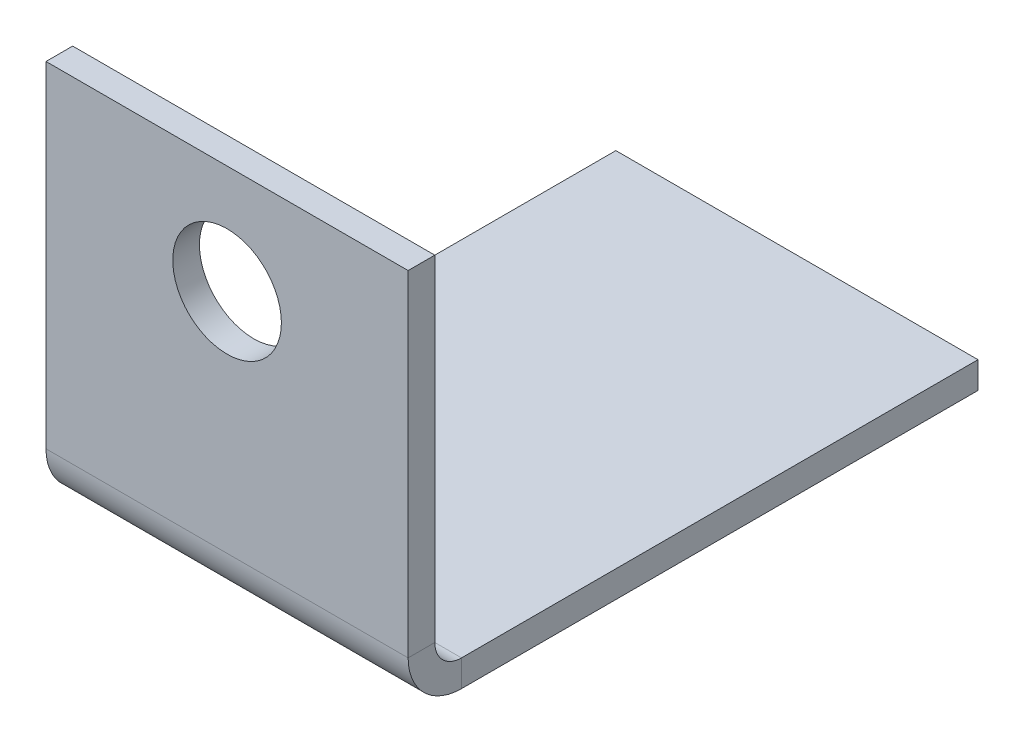
ISO-10303-21;
HEADER;
FILE_DESCRIPTION(('STEP AP214'),'2;1');
FILE_NAME('part.step','',(''),(''),'','','');
FILE_SCHEMA(('AUTOMOTIVE_DESIGN { 1 0 10303 214 1 1 1 1 }'));
ENDSEC;
DATA;
#1=APPLICATION_CONTEXT('core data for automotive mechanical design processes');
#2=APPLICATION_PROTOCOL_DEFINITION('international standard','automotive_design',2000,#1);
#3=PRODUCT_CONTEXT('',#1,'mechanical');
#4=PRODUCT('Part','Part','',(#3));
#5=PRODUCT_RELATED_PRODUCT_CATEGORY('part','',(#4));
#6=PRODUCT_DEFINITION_FORMATION('','',#4);
#7=PRODUCT_DEFINITION_CONTEXT('part definition',#1,'design');
#8=PRODUCT_DEFINITION('design','',#6,#7);
#9=PRODUCT_DEFINITION_SHAPE('','',#8);
#10=(LENGTH_UNIT() NAMED_UNIT(*) SI_UNIT(.MILLI.,.METRE.));
#11=(NAMED_UNIT(*) PLANE_ANGLE_UNIT() SI_UNIT($,.RADIAN.));
#12=(NAMED_UNIT(*) SI_UNIT($,.STERADIAN.) SOLID_ANGLE_UNIT());
#13=UNCERTAINTY_MEASURE_WITH_UNIT(LENGTH_MEASURE(1.E-05),#10,'distance_accuracy_value','');
#14=(GEOMETRIC_REPRESENTATION_CONTEXT(3) GLOBAL_UNCERTAINTY_ASSIGNED_CONTEXT((#13)) GLOBAL_UNIT_ASSIGNED_CONTEXT((#10,
#11,#12)) REPRESENTATION_CONTEXT('',''));
#15=CARTESIAN_POINT('',(0.,0.,0.));
#16=DIRECTION('',(0.,0.,1.));
#17=DIRECTION('',(1.,0.,0.));
#18=AXIS2_PLACEMENT_3D('',#15,#16,#17);
#19=CARTESIAN_POINT('',(5.,-0.7366,7.5));
#20=DIRECTION('',(1.,0.,0.));
#21=DIRECTION('',(0.,0.,-1.));
#22=AXIS2_PLACEMENT_3D('',#19,#20,#21);
#23=PLANE('',#22);
#24=DIRECTION('',(0.,0.,-1.));
#25=VECTOR('',#24,1.);
#26=CARTESIAN_POINT('',(5.,0.,7.5));
#27=LINE('',#26,#25);
#28=CARTESIAN_POINT('',(5.,0.,6.7634));
#29=VERTEX_POINT('',#28);
#30=CARTESIAN_POINT('',(5.,0.,-7.5));
#31=VERTEX_POINT('',#30);
#32=EDGE_CURVE('E91',#29,#31,#27,.T.);
#33=ORIENTED_EDGE('',*,*,#32,.F.);
#34=DIRECTION('',(0.,-1.,0.));
#35=VECTOR('',#34,1.);
#36=CARTESIAN_POINT('',(5.,0.,6.7634));
#37=LINE('',#36,#35);
#38=CARTESIAN_POINT('',(5.,-0.736600000000001,6.7634));
#39=VERTEX_POINT('',#38);
#40=EDGE_CURVE('E101',#29,#39,#37,.T.);
#41=ORIENTED_EDGE('',*,*,#40,.T.);
#42=DIRECTION('',(0.,0.,-1.));
#43=VECTOR('',#42,1.);
#44=CARTESIAN_POINT('',(5.,-0.7366,7.5));
#45=LINE('',#44,#43);
#46=CARTESIAN_POINT('',(5.,-0.7366,-7.5));
#47=VERTEX_POINT('',#46);
#48=EDGE_CURVE('E87',#39,#47,#45,.T.);
#49=ORIENTED_EDGE('',*,*,#48,.T.);
#50=DIRECTION('',(0.,1.,0.));
#51=VECTOR('',#50,1.);
#52=CARTESIAN_POINT('',(5.,-0.7366,-7.5));
#53=LINE('',#52,#51);
#54=EDGE_CURVE('E45',#47,#31,#53,.T.);
#55=ORIENTED_EDGE('',*,*,#54,.T.);
#56=EDGE_LOOP('',(#33,#41,#49,#55));
#57=FACE_BOUND('',#56,.T.);
#58=ADVANCED_FACE('F37',(#57),#23,.T.);
#59=CARTESIAN_POINT('',(0.,-0.7366,0.));
#60=DIRECTION('',(0.,-1.,0.));
#61=DIRECTION('',(0.,0.,-1.));
#62=AXIS2_PLACEMENT_3D('',#59,#60,#61);
#63=PLANE('',#62);
#64=ORIENTED_EDGE('',*,*,#48,.F.);
#65=DIRECTION('',(1.,0.,0.));
#66=VECTOR('',#65,1.);
#67=CARTESIAN_POINT('',(5.,-0.736600000000001,6.7634));
#68=LINE('',#67,#66);
#69=CARTESIAN_POINT('',(-5.,-0.7366,6.7634));
#70=VERTEX_POINT('',#69);
#71=EDGE_CURVE('E118',#39,#70,#68,.F.);
#72=ORIENTED_EDGE('',*,*,#71,.T.);
#73=DIRECTION('',(0.,0.,1.));
#74=VECTOR('',#73,1.);
#75=CARTESIAN_POINT('',(-5.,-0.7366,7.5));
#76=LINE('',#75,#74);
#77=CARTESIAN_POINT('',(-5.,-0.7366,-7.5));
#78=VERTEX_POINT('',#77);
#79=EDGE_CURVE('E96',#78,#70,#76,.T.);
#80=ORIENTED_EDGE('',*,*,#79,.F.);
#81=DIRECTION('',(-1.,0.,0.));
#82=VECTOR('',#81,1.);
#83=CARTESIAN_POINT('',(-5.,-0.7366,-7.5));
#84=LINE('',#83,#82);
#85=EDGE_CURVE('E78',#47,#78,#84,.T.);
#86=ORIENTED_EDGE('',*,*,#85,.F.);
#87=EDGE_LOOP('',(#64,#72,#80,#86));
#88=FACE_BOUND('',#87,.T.);
#89=ADVANCED_FACE('F216',(#88),#63,.T.);
#90=CARTESIAN_POINT('',(0.,0.,0.));
#91=DIRECTION('',(0.,-1.,0.));
#92=DIRECTION('',(0.,0.,-1.));
#93=AXIS2_PLACEMENT_3D('',#90,#91,#92);
#94=PLANE('',#93);
#95=DIRECTION('',(1.,0.,0.));
#96=VECTOR('',#95,1.);
#97=CARTESIAN_POINT('',(5.,0.,6.7634));
#98=LINE('',#97,#96);
#99=CARTESIAN_POINT('',(-5.,0.,6.7634));
#100=VERTEX_POINT('',#99);
#101=EDGE_CURVE('E108',#29,#100,#98,.F.);
#102=ORIENTED_EDGE('',*,*,#101,.F.);
#103=ORIENTED_EDGE('',*,*,#32,.T.);
#104=DIRECTION('',(-1.,0.,0.));
#105=VECTOR('',#104,1.);
#106=CARTESIAN_POINT('',(-5.,0.,-7.5));
#107=LINE('',#106,#105);
#108=CARTESIAN_POINT('',(-5.,0.,-7.5));
#109=VERTEX_POINT('',#108);
#110=EDGE_CURVE('E76',#31,#109,#107,.T.);
#111=ORIENTED_EDGE('',*,*,#110,.T.);
#112=DIRECTION('',(0.,0.,1.));
#113=VECTOR('',#112,1.);
#114=CARTESIAN_POINT('',(-5.,0.,7.5));
#115=LINE('',#114,#113);
#116=EDGE_CURVE('E81',#109,#100,#115,.T.);
#117=ORIENTED_EDGE('',*,*,#116,.T.);
#118=EDGE_LOOP('',(#102,#103,#111,#117));
#119=FACE_BOUND('',#118,.T.);
#120=ADVANCED_FACE('F89',(#119),#94,.F.);
#121=CARTESIAN_POINT('',(-5.,-0.7366,7.5));
#122=DIRECTION('',(-1.,0.,0.));
#123=DIRECTION('',(0.,0.,1.));
#124=AXIS2_PLACEMENT_3D('',#121,#122,#123);
#125=PLANE('',#124);
#126=DIRECTION('',(0.,-1.,0.));
#127=VECTOR('',#126,1.);
#128=CARTESIAN_POINT('',(-5.,0.,6.7634));
#129=LINE('',#128,#127);
#130=EDGE_CURVE('E84',#100,#70,#129,.T.);
#131=ORIENTED_EDGE('',*,*,#130,.F.);
#132=ORIENTED_EDGE('',*,*,#116,.F.);
#133=DIRECTION('',(0.,1.,0.));
#134=VECTOR('',#133,1.);
#135=CARTESIAN_POINT('',(-5.,-0.7366,-7.5));
#136=LINE('',#135,#134);
#137=EDGE_CURVE('E11',#78,#109,#136,.T.);
#138=ORIENTED_EDGE('',*,*,#137,.F.);
#139=ORIENTED_EDGE('',*,*,#79,.T.);
#140=EDGE_LOOP('',(#131,#132,#138,#139));
#141=FACE_BOUND('',#140,.T.);
#142=ADVANCED_FACE('F82',(#141),#125,.T.);
#143=CARTESIAN_POINT('',(-5.,-0.7366,-7.5));
#144=DIRECTION('',(0.,0.,-1.));
#145=DIRECTION('',(-1.,0.,0.));
#146=AXIS2_PLACEMENT_3D('',#143,#144,#145);
#147=PLANE('',#146);
#148=ORIENTED_EDGE('',*,*,#110,.F.);
#149=ORIENTED_EDGE('',*,*,#54,.F.);
#150=ORIENTED_EDGE('',*,*,#85,.T.);
#151=ORIENTED_EDGE('',*,*,#137,.T.);
#152=EDGE_LOOP('',(#148,#149,#150,#151));
#153=FACE_BOUND('',#152,.T.);
#154=ADVANCED_FACE('F73',(#153),#147,.T.);
#155=CARTESIAN_POINT('',(-5.,0.736599999999998,6.7634));
#156=DIRECTION('',(-1.,0.,0.));
#157=DIRECTION('',(0.,0.,1.));
#158=AXIS2_PLACEMENT_3D('',#155,#156,#157);
#159=PLANE('',#158);
#160=DIRECTION('',(0.,0.,1.));
#161=VECTOR('',#160,1.);
#162=CARTESIAN_POINT('',(-5.,0.736599999999998,7.50000000000001));
#163=LINE('',#162,#161);
#164=CARTESIAN_POINT('',(-5.,0.736599999999998,7.5));
#165=VERTEX_POINT('',#164);
#166=CARTESIAN_POINT('',(-5.,0.736599999999998,8.2366));
#167=VERTEX_POINT('',#166);
#168=EDGE_CURVE('E148',#165,#167,#163,.T.);
#169=ORIENTED_EDGE('',*,*,#168,.F.);
#170=CARTESIAN_POINT('',(-5.,0.736599999999998,6.7634));
#171=DIRECTION('',(1.,0.,0.));
#172=DIRECTION('',(0.,0.,-1.));
#173=AXIS2_PLACEMENT_3D('',#170,#171,#172);
#174=CIRCLE('',#173,0.736599999999999);
#175=EDGE_CURVE('E112',#100,#165,#174,.F.);
#176=ORIENTED_EDGE('',*,*,#175,.F.);
#177=ORIENTED_EDGE('',*,*,#130,.T.);
#178=CARTESIAN_POINT('',(-5.,0.736599999999998,6.7634));
#179=DIRECTION('',(1.,0.,0.));
#180=DIRECTION('',(0.,0.,-1.));
#181=AXIS2_PLACEMENT_3D('',#178,#179,#180);
#182=CIRCLE('',#181,1.4732);
#183=EDGE_CURVE('E53',#70,#167,#182,.F.);
#184=ORIENTED_EDGE('',*,*,#183,.T.);
#185=EDGE_LOOP('',(#169,#176,#177,#184));
#186=FACE_BOUND('',#185,.T.);
#187=ADVANCED_FACE('F231',(#186),#159,.T.);
#188=CARTESIAN_POINT('',(5.,0.736599999999998,6.7634));
#189=DIRECTION('',(-1.,0.,0.));
#190=DIRECTION('',(0.,0.,1.));
#191=AXIS2_PLACEMENT_3D('',#188,#189,#190);
#192=PLANE('',#191);
#193=CARTESIAN_POINT('',(5.,0.736599999999998,6.7634));
#194=DIRECTION('',(1.,0.,0.));
#195=DIRECTION('',(0.,0.,-1.));
#196=AXIS2_PLACEMENT_3D('',#193,#194,#195);
#197=CIRCLE('',#196,0.736599999999999);
#198=CARTESIAN_POINT('',(5.,0.736599999999998,7.5));
#199=VERTEX_POINT('',#198);
#200=EDGE_CURVE('E105',#199,#29,#197,.T.);
#201=ORIENTED_EDGE('',*,*,#200,.F.);
#202=DIRECTION('',(0.,0.,1.));
#203=VECTOR('',#202,1.);
#204=CARTESIAN_POINT('',(5.,0.736599999999998,7.50000000000001));
#205=LINE('',#204,#203);
#206=CARTESIAN_POINT('',(5.,0.736599999999998,8.2366));
#207=VERTEX_POINT('',#206);
#208=EDGE_CURVE('E147',#199,#207,#205,.T.);
#209=ORIENTED_EDGE('',*,*,#208,.T.);
#210=CARTESIAN_POINT('',(5.,0.736599999999998,6.7634));
#211=DIRECTION('',(1.,0.,0.));
#212=DIRECTION('',(0.,0.,-1.));
#213=AXIS2_PLACEMENT_3D('',#210,#211,#212);
#214=CIRCLE('',#213,1.4732);
#215=EDGE_CURVE('E115',#207,#39,#214,.T.);
#216=ORIENTED_EDGE('',*,*,#215,.T.);
#217=ORIENTED_EDGE('',*,*,#40,.F.);
#218=EDGE_LOOP('',(#201,#209,#216,#217));
#219=FACE_BOUND('',#218,.T.);
#220=ADVANCED_FACE('F209',(#219),#192,.F.);
#221=CARTESIAN_POINT('',(5.,0.736599999999998,6.7634));
#222=DIRECTION('',(1.,0.,0.));
#223=DIRECTION('',(0.,0.,1.));
#224=AXIS2_PLACEMENT_3D('',#221,#222,#223);
#225=CYLINDRICAL_SURFACE('',#224,1.4732);
#226=ORIENTED_EDGE('',*,*,#71,.F.);
#227=ORIENTED_EDGE('',*,*,#215,.F.);
#228=DIRECTION('',(-1.,0.,0.));
#229=VECTOR('',#228,1.);
#230=CARTESIAN_POINT('',(0.,0.736599999999998,8.2366));
#231=LINE('',#230,#229);
#232=EDGE_CURVE('E138',#207,#167,#231,.T.);
#233=ORIENTED_EDGE('',*,*,#232,.T.);
#234=ORIENTED_EDGE('',*,*,#183,.F.);
#235=EDGE_LOOP('',(#226,#227,#233,#234));
#236=FACE_BOUND('',#235,.T.);
#237=ADVANCED_FACE('F239',(#236),#225,.T.);
#238=CARTESIAN_POINT('',(5.,0.736599999999998,6.7634));
#239=DIRECTION('',(1.,0.,0.));
#240=DIRECTION('',(0.,0.,1.));
#241=AXIS2_PLACEMENT_3D('',#238,#239,#240);
#242=CYLINDRICAL_SURFACE('',#241,0.736599999999999);
#243=ORIENTED_EDGE('',*,*,#101,.T.);
#244=ORIENTED_EDGE('',*,*,#175,.T.);
#245=DIRECTION('',(1.,0.,0.));
#246=VECTOR('',#245,1.);
#247=CARTESIAN_POINT('',(-5.,0.736599999999998,7.50000000000001));
#248=LINE('',#247,#246);
#249=EDGE_CURVE('E151',#165,#199,#248,.T.);
#250=ORIENTED_EDGE('',*,*,#249,.T.);
#251=ORIENTED_EDGE('',*,*,#200,.T.);
#252=EDGE_LOOP('',(#243,#244,#250,#251));
#253=FACE_BOUND('',#252,.T.);
#254=ADVANCED_FACE('F213',(#253),#242,.F.);
#255=CARTESIAN_POINT('',(-5.,0.,8.2366));
#256=DIRECTION('',(1.,0.,0.));
#257=DIRECTION('',(0.,0.,-1.));
#258=AXIS2_PLACEMENT_3D('',#255,#256,#257);
#259=PLANE('',#258);
#260=ORIENTED_EDGE('',*,*,#168,.T.);
#261=DIRECTION('',(0.,-1.,0.));
#262=VECTOR('',#261,1.);
#263=CARTESIAN_POINT('',(-5.,0.,8.2366));
#264=LINE('',#263,#262);
#265=CARTESIAN_POINT('',(-5.,10.,8.2366));
#266=VERTEX_POINT('',#265);
#267=EDGE_CURVE('E131',#266,#167,#264,.T.);
#268=ORIENTED_EDGE('',*,*,#267,.F.);
#269=DIRECTION('',(0.,0.,-1.));
#270=VECTOR('',#269,1.);
#271=CARTESIAN_POINT('',(-5.,10.,8.2366));
#272=LINE('',#271,#270);
#273=CARTESIAN_POINT('',(-5.,10.,7.5));
#274=VERTEX_POINT('',#273);
#275=EDGE_CURVE('E124',#266,#274,#272,.T.);
#276=ORIENTED_EDGE('',*,*,#275,.T.);
#277=DIRECTION('',(0.,-1.,0.));
#278=VECTOR('',#277,1.);
#279=CARTESIAN_POINT('',(-5.,0.,7.5));
#280=LINE('',#279,#278);
#281=EDGE_CURVE('E135',#274,#165,#280,.T.);
#282=ORIENTED_EDGE('',*,*,#281,.T.);
#283=EDGE_LOOP('',(#260,#268,#276,#282));
#284=FACE_BOUND('',#283,.T.);
#285=ADVANCED_FACE('F243',(#284),#259,.F.);
#286=CARTESIAN_POINT('',(5.,10.,8.2366));
#287=DIRECTION('',(-1.,0.,0.));
#288=DIRECTION('',(0.,0.,1.));
#289=AXIS2_PLACEMENT_3D('',#286,#287,#288);
#290=PLANE('',#289);
#291=ORIENTED_EDGE('',*,*,#208,.F.);
#292=DIRECTION('',(0.,1.,0.));
#293=VECTOR('',#292,1.);
#294=CARTESIAN_POINT('',(5.,10.,7.5));
#295=LINE('',#294,#293);
#296=CARTESIAN_POINT('',(5.,10.,7.5));
#297=VERTEX_POINT('',#296);
#298=EDGE_CURVE('E132',#199,#297,#295,.T.);
#299=ORIENTED_EDGE('',*,*,#298,.T.);
#300=DIRECTION('',(0.,0.,-1.));
#301=VECTOR('',#300,1.);
#302=CARTESIAN_POINT('',(5.,10.,8.2366));
#303=LINE('',#302,#301);
#304=CARTESIAN_POINT('',(5.,10.,8.2366));
#305=VERTEX_POINT('',#304);
#306=EDGE_CURVE('E109',#305,#297,#303,.T.);
#307=ORIENTED_EDGE('',*,*,#306,.F.);
#308=DIRECTION('',(0.,1.,0.));
#309=VECTOR('',#308,1.);
#310=CARTESIAN_POINT('',(5.,10.,8.2366));
#311=LINE('',#310,#309);
#312=EDGE_CURVE('E141',#207,#305,#311,.T.);
#313=ORIENTED_EDGE('',*,*,#312,.F.);
#314=EDGE_LOOP('',(#291,#299,#307,#313));
#315=FACE_BOUND('',#314,.T.);
#316=ADVANCED_FACE('F182',(#315),#290,.F.);
#317=CARTESIAN_POINT('',(0.,0.,8.2366));
#318=DIRECTION('',(0.,0.,-1.));
#319=DIRECTION('',(-1.,0.,0.));
#320=AXIS2_PLACEMENT_3D('',#317,#318,#319);
#321=PLANE('',#320);
#322=CARTESIAN_POINT('',(0.,7.,8.2366));
#323=DIRECTION('',(0.,0.,1.));
#324=DIRECTION('',(1.,0.,0.));
#325=AXIS2_PLACEMENT_3D('',#322,#323,#324);
#326=CIRCLE('',#325,1.5);
#327=CARTESIAN_POINT('',(1.5,7.,8.2366));
#328=VERTEX_POINT('',#327);
#329=EDGE_CURVE('E156',#328,#328,#326,.T.);
#330=ORIENTED_EDGE('',*,*,#329,.F.);
#331=EDGE_LOOP('',(#330));
#332=FACE_BOUND('',#331,.T.);
#333=ORIENTED_EDGE('',*,*,#232,.F.);
#334=ORIENTED_EDGE('',*,*,#312,.T.);
#335=DIRECTION('',(-1.,0.,0.));
#336=VECTOR('',#335,1.);
#337=CARTESIAN_POINT('',(-5.,10.,8.2366));
#338=LINE('',#337,#336);
#339=EDGE_CURVE('E127',#305,#266,#338,.T.);
#340=ORIENTED_EDGE('',*,*,#339,.T.);
#341=ORIENTED_EDGE('',*,*,#267,.T.);
#342=EDGE_LOOP('',(#333,#334,#340,#341));
#343=FACE_BOUND('',#342,.T.);
#344=ADVANCED_FACE('F169',(#332,#343),#321,.F.);
#345=CARTESIAN_POINT('',(0.,0.,7.5));
#346=DIRECTION('',(0.,0.,-1.));
#347=DIRECTION('',(-1.,0.,0.));
#348=AXIS2_PLACEMENT_3D('',#345,#346,#347);
#349=PLANE('',#348);
#350=CARTESIAN_POINT('',(0.,7.,7.5));
#351=DIRECTION('',(0.,0.,-1.));
#352=DIRECTION('',(-1.,0.,0.));
#353=AXIS2_PLACEMENT_3D('',#350,#351,#352);
#354=CIRCLE('',#353,1.5);
#355=CARTESIAN_POINT('',(-1.5,7.,7.5));
#356=VERTEX_POINT('',#355);
#357=EDGE_CURVE('E40',#356,#356,#354,.T.);
#358=ORIENTED_EDGE('',*,*,#357,.F.);
#359=EDGE_LOOP('',(#358));
#360=FACE_BOUND('',#359,.T.);
#361=ORIENTED_EDGE('',*,*,#298,.F.);
#362=ORIENTED_EDGE('',*,*,#249,.F.);
#363=ORIENTED_EDGE('',*,*,#281,.F.);
#364=DIRECTION('',(-1.,0.,0.));
#365=VECTOR('',#364,1.);
#366=CARTESIAN_POINT('',(-5.,10.,7.5));
#367=LINE('',#366,#365);
#368=EDGE_CURVE('E128',#297,#274,#367,.T.);
#369=ORIENTED_EDGE('',*,*,#368,.F.);
#370=EDGE_LOOP('',(#361,#362,#363,#369));
#371=FACE_BOUND('',#370,.T.);
#372=ADVANCED_FACE('F165',(#360,#371),#349,.T.);
#373=CARTESIAN_POINT('',(-5.,10.,8.2366));
#374=DIRECTION('',(0.,-1.,0.));
#375=DIRECTION('',(0.,0.,-1.));
#376=AXIS2_PLACEMENT_3D('',#373,#374,#375);
#377=PLANE('',#376);
#378=ORIENTED_EDGE('',*,*,#368,.T.);
#379=ORIENTED_EDGE('',*,*,#275,.F.);
#380=ORIENTED_EDGE('',*,*,#339,.F.);
#381=ORIENTED_EDGE('',*,*,#306,.T.);
#382=EDGE_LOOP('',(#378,#379,#380,#381));
#383=FACE_BOUND('',#382,.T.);
#384=ADVANCED_FACE('F168',(#383),#377,.F.);
#385=CARTESIAN_POINT('',(0.,7.,-1.7634));
#386=DIRECTION('',(0.,0.,1.));
#387=DIRECTION('',(1.,0.,0.));
#388=AXIS2_PLACEMENT_3D('',#385,#386,#387);
#389=CYLINDRICAL_SURFACE('',#388,1.5);
#390=ORIENTED_EDGE('',*,*,#357,.T.);
#391=EDGE_LOOP('',(#390));
#392=FACE_BOUND('',#391,.T.);
#393=ORIENTED_EDGE('',*,*,#329,.T.);
#394=EDGE_LOOP('',(#393));
#395=FACE_BOUND('',#394,.T.);
#396=ADVANCED_FACE('F163',(#392,#395),#389,.F.);
#397=CLOSED_SHELL('',(#58,#89,#120,#142,#154,#187,#220,#237,#254,#285,#316,#344,#372,#384,#396));
#398=MANIFOLD_SOLID_BREP('B2',#397);
#399=ADVANCED_BREP_SHAPE_REPRESENTATION('',(#18,#398),#14);
#400=SHAPE_DEFINITION_REPRESENTATION(#9,#399);
ENDSEC;
END-ISO-10303-21;
